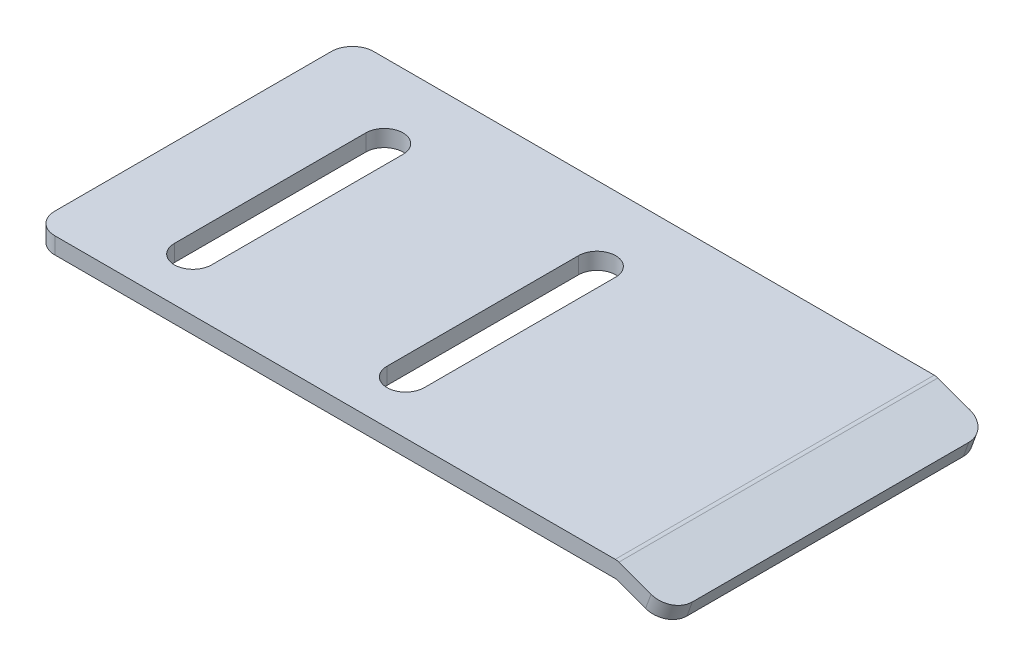
ISO-10303-21;
HEADER;
FILE_DESCRIPTION(('STEP AP214'),'2;1');
FILE_NAME('part.step','',(''),(''),'','','');
FILE_SCHEMA(('AUTOMOTIVE_DESIGN { 1 0 10303 214 1 1 1 1 }'));
ENDSEC;
DATA;
#1=APPLICATION_CONTEXT('core data for automotive mechanical design processes');
#2=APPLICATION_PROTOCOL_DEFINITION('international standard','automotive_design',2000,#1);
#3=PRODUCT_CONTEXT('',#1,'mechanical');
#4=PRODUCT('Part','Part','',(#3));
#5=PRODUCT_RELATED_PRODUCT_CATEGORY('part','',(#4));
#6=PRODUCT_DEFINITION_FORMATION('','',#4);
#7=PRODUCT_DEFINITION_CONTEXT('part definition',#1,'design');
#8=PRODUCT_DEFINITION('design','',#6,#7);
#9=PRODUCT_DEFINITION_SHAPE('','',#8);
#10=(LENGTH_UNIT() NAMED_UNIT(*) SI_UNIT(.MILLI.,.METRE.));
#11=(NAMED_UNIT(*) PLANE_ANGLE_UNIT() SI_UNIT($,.RADIAN.));
#12=(NAMED_UNIT(*) SI_UNIT($,.STERADIAN.) SOLID_ANGLE_UNIT());
#13=UNCERTAINTY_MEASURE_WITH_UNIT(LENGTH_MEASURE(1.E-05),#10,'distance_accuracy_value','');
#14=(GEOMETRIC_REPRESENTATION_CONTEXT(3) GLOBAL_UNCERTAINTY_ASSIGNED_CONTEXT((#13)) GLOBAL_UNIT_ASSIGNED_CONTEXT((#10,
#11,#12)) REPRESENTATION_CONTEXT('',''));
#15=CARTESIAN_POINT('',(0.,0.,0.));
#16=DIRECTION('',(0.,0.,1.));
#17=DIRECTION('',(1.,0.,0.));
#18=AXIS2_PLACEMENT_3D('',#15,#16,#17);
#19=CARTESIAN_POINT('',(-37.5773457805497,7.01414024321962,30.));
#20=DIRECTION('',(1.,0.,0.));
#21=DIRECTION('',(0.,1.,0.));
#22=AXIS2_PLACEMENT_3D('',#19,#20,#21);
#23=PLANE('',#22);
#24=DIRECTION('',(0.,0.,-1.));
#25=VECTOR('',#24,1.);
#26=CARTESIAN_POINT('',(-37.5773457805497,7.01414024321962,30.));
#27=LINE('',#26,#25);
#28=CARTESIAN_POINT('',(-37.5773457805497,7.01414024321962,28.));
#29=VERTEX_POINT('',#28);
#30=CARTESIAN_POINT('',(-37.5773457805497,7.01414024321962,2.));
#31=VERTEX_POINT('',#30);
#32=EDGE_CURVE('E264',#29,#31,#27,.T.);
#33=ORIENTED_EDGE('',*,*,#32,.F.);
#34=DIRECTION('',(0.,-1.,0.));
#35=VECTOR('',#34,1.);
#36=CARTESIAN_POINT('',(-37.5773457805497,7.01414024321962,28.));
#37=LINE('',#36,#35);
#38=CARTESIAN_POINT('',(-37.5773457805497,8.5792292670785,28.));
#39=VERTEX_POINT('',#38);
#40=EDGE_CURVE('E291',#29,#39,#37,.F.);
#41=ORIENTED_EDGE('',*,*,#40,.T.);
#42=DIRECTION('',(0.,0.,-1.));
#43=VECTOR('',#42,1.);
#44=CARTESIAN_POINT('',(-37.5773457805497,8.5792292670785,30.));
#45=LINE('',#44,#43);
#46=CARTESIAN_POINT('',(-37.5773457805497,8.5792292670785,2.));
#47=VERTEX_POINT('',#46);
#48=EDGE_CURVE('E244',#39,#47,#45,.T.);
#49=ORIENTED_EDGE('',*,*,#48,.T.);
#50=DIRECTION('',(0.,-1.,0.));
#51=VECTOR('',#50,1.);
#52=CARTESIAN_POINT('',(-37.5773457805497,7.01414024321962,2.));
#53=LINE('',#52,#51);
#54=EDGE_CURVE('E288',#47,#31,#53,.T.);
#55=ORIENTED_EDGE('',*,*,#54,.T.);
#56=EDGE_LOOP('',(#33,#41,#49,#55));
#57=FACE_BOUND('',#56,.T.);
#58=ADVANCED_FACE('F33',(#57),#23,.F.);
#59=CARTESIAN_POINT('',(17.2226542194503,7.01414024321963,30.));
#60=DIRECTION('',(0.,1.,0.));
#61=DIRECTION('',(-1.,0.,0.));
#62=AXIS2_PLACEMENT_3D('',#59,#60,#61);
#63=PLANE('',#62);
#64=DIRECTION('',(0.,0.,1.));
#65=VECTOR('',#64,1.);
#66=CARTESIAN_POINT('',(-9.32734578054968,7.01414024321962,30.));
#67=LINE('',#66,#65);
#68=CARTESIAN_POINT('',(-9.32734578054968,7.01414024321963,7.));
#69=VERTEX_POINT('',#68);
#70=CARTESIAN_POINT('',(-9.32734578054968,7.01414024321962,25.));
#71=VERTEX_POINT('',#70);
#72=EDGE_CURVE('E194',#69,#71,#67,.T.);
#73=ORIENTED_EDGE('',*,*,#72,.T.);
#74=CARTESIAN_POINT('',(-7.57734578054967,7.01414024321963,25.));
#75=DIRECTION('',(0.,1.,0.));
#76=DIRECTION('',(-1.,0.,0.));
#77=AXIS2_PLACEMENT_3D('',#74,#75,#76);
#78=CIRCLE('',#77,1.75000000000001);
#79=CARTESIAN_POINT('',(-5.82734578054966,7.01414024321963,25.));
#80=VERTEX_POINT('',#79);
#81=EDGE_CURVE('E197',#71,#80,#78,.T.);
#82=ORIENTED_EDGE('',*,*,#81,.T.);
#83=DIRECTION('',(0.,0.,-1.));
#84=VECTOR('',#83,1.);
#85=CARTESIAN_POINT('',(-5.82734578054966,7.01414024321963,30.));
#86=LINE('',#85,#84);
#87=CARTESIAN_POINT('',(-5.82734578054967,7.01414024321963,7.));
#88=VERTEX_POINT('',#87);
#89=EDGE_CURVE('E189',#80,#88,#86,.T.);
#90=ORIENTED_EDGE('',*,*,#89,.T.);
#91=CARTESIAN_POINT('',(-7.57734578054968,7.01414024321963,7.));
#92=DIRECTION('',(0.,1.,0.));
#93=DIRECTION('',(-1.,0.,0.));
#94=AXIS2_PLACEMENT_3D('',#91,#92,#93);
#95=CIRCLE('',#94,1.75);
#96=EDGE_CURVE('E169',#88,#69,#95,.T.);
#97=ORIENTED_EDGE('',*,*,#96,.T.);
#98=EDGE_LOOP('',(#73,#82,#90,#97));
#99=FACE_BOUND('',#98,.T.);
#100=DIRECTION('',(0.,0.,1.));
#101=VECTOR('',#100,1.);
#102=CARTESIAN_POINT('',(-29.3273457805497,7.01414024321962,30.));
#103=LINE('',#102,#101);
#104=CARTESIAN_POINT('',(-29.3273457805497,7.01414024321962,7.));
#105=VERTEX_POINT('',#104);
#106=CARTESIAN_POINT('',(-29.3273457805497,7.01414024321962,25.));
#107=VERTEX_POINT('',#106);
#108=EDGE_CURVE('E226',#105,#107,#103,.T.);
#109=ORIENTED_EDGE('',*,*,#108,.T.);
#110=CARTESIAN_POINT('',(-27.5773457805497,7.01414024321962,25.));
#111=DIRECTION('',(0.,1.,0.));
#112=DIRECTION('',(-1.,0.,0.));
#113=AXIS2_PLACEMENT_3D('',#110,#111,#112);
#114=CIRCLE('',#113,1.75000000000001);
#115=CARTESIAN_POINT('',(-25.8273457805497,7.01414024321962,25.));
#116=VERTEX_POINT('',#115);
#117=EDGE_CURVE('E229',#107,#116,#114,.T.);
#118=ORIENTED_EDGE('',*,*,#117,.T.);
#119=DIRECTION('',(0.,0.,-1.));
#120=VECTOR('',#119,1.);
#121=CARTESIAN_POINT('',(-25.8273457805496,7.01414024321962,30.));
#122=LINE('',#121,#120);
#123=CARTESIAN_POINT('',(-25.8273457805497,7.01414024321962,7.));
#124=VERTEX_POINT('',#123);
#125=EDGE_CURVE('E214',#116,#124,#122,.T.);
#126=ORIENTED_EDGE('',*,*,#125,.T.);
#127=CARTESIAN_POINT('',(-27.5773457805497,7.01414024321962,7.));
#128=DIRECTION('',(0.,1.,0.));
#129=DIRECTION('',(-1.,0.,0.));
#130=AXIS2_PLACEMENT_3D('',#127,#128,#129);
#131=CIRCLE('',#130,1.75);
#132=EDGE_CURVE('E223',#124,#105,#131,.T.);
#133=ORIENTED_EDGE('',*,*,#132,.T.);
#134=EDGE_LOOP('',(#109,#118,#126,#133));
#135=FACE_BOUND('',#134,.T.);
#136=DIRECTION('',(1.,0.,0.));
#137=VECTOR('',#136,1.);
#138=CARTESIAN_POINT('',(17.2226542194503,7.01414024321963,30.));
#139=LINE('',#138,#137);
#140=CARTESIAN_POINT('',(-35.5773457805496,7.01414024321962,30.));
#141=VERTEX_POINT('',#140);
#142=CARTESIAN_POINT('',(17.2226542194503,7.01414024321963,30.));
#143=VERTEX_POINT('',#142);
#144=EDGE_CURVE('E233',#141,#143,#139,.T.);
#145=ORIENTED_EDGE('',*,*,#144,.F.);
#146=CARTESIAN_POINT('',(-35.5773457805497,7.01414024321962,28.));
#147=DIRECTION('',(0.,1.,0.));
#148=DIRECTION('',(-1.,0.,0.));
#149=AXIS2_PLACEMENT_3D('',#146,#147,#148);
#150=CIRCLE('',#149,2.);
#151=EDGE_CURVE('E286',#141,#29,#150,.F.);
#152=ORIENTED_EDGE('',*,*,#151,.T.);
#153=ORIENTED_EDGE('',*,*,#32,.T.);
#154=CARTESIAN_POINT('',(-35.5773457805497,7.01414024321962,2.));
#155=DIRECTION('',(0.,1.,0.));
#156=DIRECTION('',(-1.,0.,0.));
#157=AXIS2_PLACEMENT_3D('',#154,#155,#156);
#158=CIRCLE('',#157,2.);
#159=CARTESIAN_POINT('',(-35.5773457805496,7.01414024321962,0.));
#160=VERTEX_POINT('',#159);
#161=EDGE_CURVE('E284',#31,#160,#158,.F.);
#162=ORIENTED_EDGE('',*,*,#161,.T.);
#163=DIRECTION('',(1.,0.,0.));
#164=VECTOR('',#163,1.);
#165=CARTESIAN_POINT('',(17.2226542194503,7.01414024321963,0.));
#166=LINE('',#165,#164);
#167=CARTESIAN_POINT('',(17.2226542194503,7.01414024321963,0.));
#168=VERTEX_POINT('',#167);
#169=EDGE_CURVE('E232',#160,#168,#166,.T.);
#170=ORIENTED_EDGE('',*,*,#169,.T.);
#171=DIRECTION('',(0.,0.,-1.));
#172=VECTOR('',#171,1.);
#173=CARTESIAN_POINT('',(17.2226542194503,7.01414024321963,30.));
#174=LINE('',#173,#172);
#175=EDGE_CURVE('E261',#143,#168,#174,.T.);
#176=ORIENTED_EDGE('',*,*,#175,.F.);
#177=EDGE_LOOP('',(#145,#152,#153,#162,#170,#176));
#178=FACE_BOUND('',#177,.T.);
#179=ADVANCED_FACE('F359',(#99,#135,#178),#63,.F.);
#180=CARTESIAN_POINT('',(21.8696240044618,5.32278156194103,30.));
#181=DIRECTION('',(0.342020143325669,0.939692620785908,0.));
#182=DIRECTION('',(-0.939692620785908,0.342020143325669,0.));
#183=AXIS2_PLACEMENT_3D('',#180,#181,#182);
#184=PLANE('',#183);
#185=DIRECTION('',(0.,0.,-1.));
#186=VECTOR('',#185,1.);
#187=CARTESIAN_POINT('',(21.8696240044618,5.32278156194103,30.));
#188=LINE('',#187,#186);
#189=CARTESIAN_POINT('',(21.8696240044618,5.32278156194103,28.));
#190=VERTEX_POINT('',#189);
#191=CARTESIAN_POINT('',(21.8696240044618,5.32278156194103,2.));
#192=VERTEX_POINT('',#191);
#193=EDGE_CURVE('E258',#190,#192,#188,.T.);
#194=ORIENTED_EDGE('',*,*,#193,.F.);
#195=CARTESIAN_POINT('',(19.99023876289,6.00682184859236,28.));
#196=DIRECTION('',(0.342020143325669,0.939692620785908,0.));
#197=DIRECTION('',(-0.939692620785908,0.342020143325669,0.));
#198=AXIS2_PLACEMENT_3D('',#195,#196,#197);
#199=CIRCLE('',#198,2.);
#200=CARTESIAN_POINT('',(19.99023876289,6.00682184859237,30.));
#201=VERTEX_POINT('',#200);
#202=EDGE_CURVE('E11',#190,#201,#199,.F.);
#203=ORIENTED_EDGE('',*,*,#202,.T.);
#204=DIRECTION('',(0.939692620785908,-0.342020143325669,0.));
#205=VECTOR('',#204,1.);
#206=CARTESIAN_POINT('',(21.8696240044618,5.32278156194103,30.));
#207=LINE('',#206,#205);
#208=EDGE_CURVE('E235',#143,#201,#207,.T.);
#209=ORIENTED_EDGE('',*,*,#208,.F.);
#210=ORIENTED_EDGE('',*,*,#175,.T.);
#211=DIRECTION('',(0.939692620785908,-0.342020143325669,0.));
#212=VECTOR('',#211,1.);
#213=CARTESIAN_POINT('',(21.8696240044618,5.32278156194103,0.));
#214=LINE('',#213,#212);
#215=CARTESIAN_POINT('',(19.99023876289,6.00682184859236,0.));
#216=VERTEX_POINT('',#215);
#217=EDGE_CURVE('E246',#168,#216,#214,.T.);
#218=ORIENTED_EDGE('',*,*,#217,.T.);
#219=CARTESIAN_POINT('',(19.99023876289,6.00682184859237,2.));
#220=DIRECTION('',(0.342020143325669,0.939692620785908,0.));
#221=DIRECTION('',(-0.939692620785908,0.342020143325669,0.));
#222=AXIS2_PLACEMENT_3D('',#219,#220,#221);
#223=CIRCLE('',#222,2.);
#224=EDGE_CURVE('E41',#216,#192,#223,.F.);
#225=ORIENTED_EDGE('',*,*,#224,.T.);
#226=EDGE_LOOP('',(#194,#203,#209,#210,#218,#225));
#227=FACE_BOUND('',#226,.T.);
#228=ADVANCED_FACE('F312',(#227),#184,.F.);
#229=CARTESIAN_POINT('',(22.3826542194503,6.73232049311989,30.));
#230=DIRECTION('',(-0.939692620785908,0.342020143325669,0.));
#231=DIRECTION('',(-0.342020143325669,-0.939692620785908,0.));
#232=AXIS2_PLACEMENT_3D('',#229,#230,#231);
#233=PLANE('',#232);
#234=DIRECTION('',(0.,0.,-1.));
#235=VECTOR('',#234,1.);
#236=CARTESIAN_POINT('',(22.3826542194503,6.73232049311989,30.));
#237=LINE('',#236,#235);
#238=CARTESIAN_POINT('',(22.3826542194503,6.73232049311989,28.));
#239=VERTEX_POINT('',#238);
#240=CARTESIAN_POINT('',(22.3826542194503,6.73232049311989,2.));
#241=VERTEX_POINT('',#240);
#242=EDGE_CURVE('E255',#239,#241,#237,.T.);
#243=ORIENTED_EDGE('',*,*,#242,.F.);
#244=DIRECTION('',(0.342020143325669,0.939692620785908,0.));
#245=VECTOR('',#244,1.);
#246=CARTESIAN_POINT('',(22.3826542194503,6.73232049311989,28.));
#247=LINE('',#246,#245);
#248=EDGE_CURVE('E308',#239,#190,#247,.F.);
#249=ORIENTED_EDGE('',*,*,#248,.T.);
#250=ORIENTED_EDGE('',*,*,#193,.T.);
#251=DIRECTION('',(0.342020143325669,0.939692620785908,0.));
#252=VECTOR('',#251,1.);
#253=CARTESIAN_POINT('',(22.3826542194503,6.73232049311989,2.));
#254=LINE('',#253,#252);
#255=EDGE_CURVE('E305',#192,#241,#254,.T.);
#256=ORIENTED_EDGE('',*,*,#255,.T.);
#257=EDGE_LOOP('',(#243,#249,#250,#256));
#258=FACE_BOUND('',#257,.T.);
#259=ADVANCED_FACE('F320',(#258),#233,.F.);
#260=CARTESIAN_POINT('',(17.3083140672064,8.5792292670785,30.));
#261=DIRECTION('',(-0.342020143325669,-0.939692620785908,0.));
#262=DIRECTION('',(0.939692620785908,-0.342020143325669,0.));
#263=AXIS2_PLACEMENT_3D('',#260,#261,#262);
#264=PLANE('',#263);
#265=DIRECTION('',(-0.939692620785908,0.342020143325669,0.));
#266=VECTOR('',#265,1.);
#267=CARTESIAN_POINT('',(17.3083140672064,8.5792292670785,30.));
#268=LINE('',#267,#266);
#269=CARTESIAN_POINT('',(20.5032689778785,7.41636077977123,30.));
#270=VERTEX_POINT('',#269);
#271=CARTESIAN_POINT('',(17.4740072298236,8.51892188786441,30.));
#272=VERTEX_POINT('',#271);
#273=EDGE_CURVE('E239',#270,#272,#268,.T.);
#274=ORIENTED_EDGE('',*,*,#273,.F.);
#275=CARTESIAN_POINT('',(20.5032689778785,7.41636077977123,28.));
#276=DIRECTION('',(-0.342020143325669,-0.939692620785908,0.));
#277=DIRECTION('',(0.939692620785908,-0.342020143325669,0.));
#278=AXIS2_PLACEMENT_3D('',#275,#276,#277);
#279=CIRCLE('',#278,2.);
#280=EDGE_CURVE('E303',#270,#239,#279,.F.);
#281=ORIENTED_EDGE('',*,*,#280,.T.);
#282=ORIENTED_EDGE('',*,*,#242,.T.);
#283=CARTESIAN_POINT('',(20.5032689778785,7.41636077977123,2.));
#284=DIRECTION('',(-0.342020143325669,-0.939692620785908,0.));
#285=DIRECTION('',(0.939692620785908,-0.342020143325669,0.));
#286=AXIS2_PLACEMENT_3D('',#283,#284,#285);
#287=CIRCLE('',#286,2.);
#288=CARTESIAN_POINT('',(20.5032689778785,7.41636077977123,0.));
#289=VERTEX_POINT('',#288);
#290=EDGE_CURVE('E301',#241,#289,#287,.F.);
#291=ORIENTED_EDGE('',*,*,#290,.T.);
#292=DIRECTION('',(-0.939692620785908,0.342020143325669,0.));
#293=VECTOR('',#292,1.);
#294=CARTESIAN_POINT('',(17.3083140672064,8.5792292670785,0.));
#295=LINE('',#294,#293);
#296=CARTESIAN_POINT('',(17.4740072298236,8.51892188786441,0.));
#297=VERTEX_POINT('',#296);
#298=EDGE_CURVE('E249',#289,#297,#295,.T.);
#299=ORIENTED_EDGE('',*,*,#298,.T.);
#300=DIRECTION('',(0.,0.,-1.));
#301=VECTOR('',#300,1.);
#302=CARTESIAN_POINT('',(17.4740072298236,8.51892188786441,30.));
#303=LINE('',#302,#301);
#304=EDGE_CURVE('E273',#297,#272,#303,.F.);
#305=ORIENTED_EDGE('',*,*,#304,.T.);
#306=EDGE_LOOP('',(#274,#281,#282,#291,#299,#305));
#307=FACE_BOUND('',#306,.T.);
#308=ADVANCED_FACE('F325',(#307),#264,.F.);
#309=CARTESIAN_POINT('',(-37.5773457805497,8.5792292670785,30.));
#310=DIRECTION('',(0.,-1.,0.));
#311=DIRECTION('',(0.,0.,-1.));
#312=AXIS2_PLACEMENT_3D('',#309,#310,#311);
#313=PLANE('',#312);
#314=DIRECTION('',(0.,0.,-1.));
#315=VECTOR('',#314,1.);
#316=CARTESIAN_POINT('',(-5.82734578054966,8.5792292670785,25.));
#317=LINE('',#316,#315);
#318=CARTESIAN_POINT('',(-5.82734578054967,8.5792292670785,25.));
#319=VERTEX_POINT('',#318);
#320=CARTESIAN_POINT('',(-5.82734578054968,8.5792292670785,7.));
#321=VERTEX_POINT('',#320);
#322=EDGE_CURVE('E175',#319,#321,#317,.T.);
#323=ORIENTED_EDGE('',*,*,#322,.F.);
#324=CARTESIAN_POINT('',(-7.57734578054967,8.5792292670785,25.));
#325=DIRECTION('',(0.,1.,0.));
#326=DIRECTION('',(0.,0.,1.));
#327=AXIS2_PLACEMENT_3D('',#324,#325,#326);
#328=CIRCLE('',#327,1.75000000000001);
#329=CARTESIAN_POINT('',(-9.32734578054968,8.5792292670785,25.));
#330=VERTEX_POINT('',#329);
#331=EDGE_CURVE('E56',#330,#319,#328,.T.);
#332=ORIENTED_EDGE('',*,*,#331,.F.);
#333=DIRECTION('',(0.,0.,1.));
#334=VECTOR('',#333,1.);
#335=CARTESIAN_POINT('',(-9.32734578054968,8.5792292670785,25.));
#336=LINE('',#335,#334);
#337=CARTESIAN_POINT('',(-9.32734578054968,8.5792292670785,7.));
#338=VERTEX_POINT('',#337);
#339=EDGE_CURVE('E182',#338,#330,#336,.T.);
#340=ORIENTED_EDGE('',*,*,#339,.F.);
#341=CARTESIAN_POINT('',(-7.57734578054968,8.5792292670785,7.));
#342=DIRECTION('',(0.,1.,0.));
#343=DIRECTION('',(0.,0.,1.));
#344=AXIS2_PLACEMENT_3D('',#341,#342,#343);
#345=CIRCLE('',#344,1.75);
#346=EDGE_CURVE('E166',#321,#338,#345,.T.);
#347=ORIENTED_EDGE('',*,*,#346,.F.);
#348=EDGE_LOOP('',(#323,#332,#340,#347));
#349=FACE_BOUND('',#348,.T.);
#350=DIRECTION('',(0.,0.,-1.));
#351=VECTOR('',#350,1.);
#352=CARTESIAN_POINT('',(-25.8273457805497,8.5792292670785,25.));
#353=LINE('',#352,#351);
#354=CARTESIAN_POINT('',(-25.8273457805497,8.5792292670785,25.));
#355=VERTEX_POINT('',#354);
#356=CARTESIAN_POINT('',(-25.8273457805497,8.5792292670785,7.));
#357=VERTEX_POINT('',#356);
#358=EDGE_CURVE('E202',#355,#357,#353,.T.);
#359=ORIENTED_EDGE('',*,*,#358,.F.);
#360=CARTESIAN_POINT('',(-27.5773457805497,8.5792292670785,25.));
#361=DIRECTION('',(0.,1.,0.));
#362=DIRECTION('',(0.,0.,1.));
#363=AXIS2_PLACEMENT_3D('',#360,#361,#362);
#364=CIRCLE('',#363,1.75000000000001);
#365=CARTESIAN_POINT('',(-29.3273457805497,8.5792292670785,25.));
#366=VERTEX_POINT('',#365);
#367=EDGE_CURVE('E200',#366,#355,#364,.T.);
#368=ORIENTED_EDGE('',*,*,#367,.F.);
#369=DIRECTION('',(0.,0.,1.));
#370=VECTOR('',#369,1.);
#371=CARTESIAN_POINT('',(-29.3273457805497,8.5792292670785,25.));
#372=LINE('',#371,#370);
#373=CARTESIAN_POINT('',(-29.3273457805497,8.5792292670785,7.));
#374=VERTEX_POINT('',#373);
#375=EDGE_CURVE('E208',#374,#366,#372,.T.);
#376=ORIENTED_EDGE('',*,*,#375,.F.);
#377=CARTESIAN_POINT('',(-27.5773457805497,8.5792292670785,7.));
#378=DIRECTION('',(0.,1.,0.));
#379=DIRECTION('',(0.,0.,1.));
#380=AXIS2_PLACEMENT_3D('',#377,#378,#379);
#381=CIRCLE('',#380,1.75);
#382=EDGE_CURVE('E205',#357,#374,#381,.T.);
#383=ORIENTED_EDGE('',*,*,#382,.F.);
#384=EDGE_LOOP('',(#359,#368,#376,#383));
#385=FACE_BOUND('',#384,.T.);
#386=ORIENTED_EDGE('',*,*,#48,.F.);
#387=CARTESIAN_POINT('',(-35.5773457805497,8.5792292670785,28.));
#388=DIRECTION('',(0.,-1.,0.));
#389=DIRECTION('',(0.,0.,-1.));
#390=AXIS2_PLACEMENT_3D('',#387,#388,#389);
#391=CIRCLE('',#390,2.);
#392=CARTESIAN_POINT('',(-35.5773457805497,8.5792292670785,30.));
#393=VERTEX_POINT('',#392);
#394=EDGE_CURVE('E295',#39,#393,#391,.F.);
#395=ORIENTED_EDGE('',*,*,#394,.T.);
#396=DIRECTION('',(-1.,0.,0.));
#397=VECTOR('',#396,1.);
#398=CARTESIAN_POINT('',(-37.5773457805497,8.5792292670785,30.));
#399=LINE('',#398,#397);
#400=CARTESIAN_POINT('',(17.131987086498,8.5792292670785,30.));
#401=VERTEX_POINT('',#400);
#402=EDGE_CURVE('E241',#401,#393,#399,.T.);
#403=ORIENTED_EDGE('',*,*,#402,.F.);
#404=DIRECTION('',(0.,0.,-1.));
#405=VECTOR('',#404,1.);
#406=CARTESIAN_POINT('',(17.131987086498,8.5792292670785,30.));
#407=LINE('',#406,#405);
#408=CARTESIAN_POINT('',(17.131987086498,8.5792292670785,0.));
#409=VERTEX_POINT('',#408);
#410=EDGE_CURVE('E267',#401,#409,#407,.T.);
#411=ORIENTED_EDGE('',*,*,#410,.T.);
#412=DIRECTION('',(-1.,0.,0.));
#413=VECTOR('',#412,1.);
#414=CARTESIAN_POINT('',(-37.5773457805497,8.5792292670785,0.));
#415=LINE('',#414,#413);
#416=CARTESIAN_POINT('',(-35.5773457805497,8.5792292670785,0.));
#417=VERTEX_POINT('',#416);
#418=EDGE_CURVE('E236',#409,#417,#415,.T.);
#419=ORIENTED_EDGE('',*,*,#418,.T.);
#420=CARTESIAN_POINT('',(-35.5773457805497,8.5792292670785,2.));
#421=DIRECTION('',(0.,-1.,0.));
#422=DIRECTION('',(0.,0.,-1.));
#423=AXIS2_PLACEMENT_3D('',#420,#421,#422);
#424=CIRCLE('',#423,2.);
#425=EDGE_CURVE('E293',#417,#47,#424,.F.);
#426=ORIENTED_EDGE('',*,*,#425,.T.);
#427=EDGE_LOOP('',(#386,#395,#403,#411,#419,#426));
#428=FACE_BOUND('',#427,.T.);
#429=ADVANCED_FACE('F179',(#349,#385,#428),#313,.F.);
#430=CARTESIAN_POINT('',(0.,0.,30.));
#431=DIRECTION('',(0.,0.,-1.));
#432=DIRECTION('',(-1.,0.,0.));
#433=AXIS2_PLACEMENT_3D('',#430,#431,#432);
#434=PLANE('',#433);
#435=ORIENTED_EDGE('',*,*,#402,.T.);
#436=DIRECTION('',(0.,-1.,0.));
#437=VECTOR('',#436,1.);
#438=CARTESIAN_POINT('',(-35.5773457805496,-1.57733792768656E-13,30.));
#439=LINE('',#438,#437);
#440=EDGE_CURVE('E281',#393,#141,#439,.T.);
#441=ORIENTED_EDGE('',*,*,#440,.T.);
#442=ORIENTED_EDGE('',*,*,#144,.T.);
#443=ORIENTED_EDGE('',*,*,#208,.T.);
#444=DIRECTION('',(0.342020143325669,0.939692620785908,0.));
#445=VECTOR('',#444,1.);
#446=CARTESIAN_POINT('',(15.721269712977,-5.72207422039438,30.));
#447=LINE('',#446,#445);
#448=EDGE_CURVE('E278',#201,#270,#447,.T.);
#449=ORIENTED_EDGE('',*,*,#448,.T.);
#450=ORIENTED_EDGE('',*,*,#273,.T.);
#451=CARTESIAN_POINT('',(17.131987086498,7.5792292670785,30.));
#452=DIRECTION('',(0.,0.,-1.));
#453=DIRECTION('',(-1.,0.,0.));
#454=AXIS2_PLACEMENT_3D('',#451,#452,#453);
#455=CIRCLE('',#454,1.);
#456=EDGE_CURVE('E276',#272,#401,#455,.F.);
#457=ORIENTED_EDGE('',*,*,#456,.T.);
#458=EDGE_LOOP('',(#435,#441,#442,#443,#449,#450,#457));
#459=FACE_BOUND('',#458,.T.);
#460=ADVANCED_FACE('F336',(#459),#434,.F.);
#461=CARTESIAN_POINT('',(0.,0.,0.));
#462=DIRECTION('',(0.,0.,-1.));
#463=DIRECTION('',(-1.,0.,0.));
#464=AXIS2_PLACEMENT_3D('',#461,#462,#463);
#465=PLANE('',#464);
#466=ORIENTED_EDGE('',*,*,#169,.F.);
#467=DIRECTION('',(0.,-1.,0.));
#468=VECTOR('',#467,1.);
#469=CARTESIAN_POINT('',(-35.5773457805497,8.57922926707851,0.));
#470=LINE('',#469,#468);
#471=EDGE_CURVE('E299',#160,#417,#470,.F.);
#472=ORIENTED_EDGE('',*,*,#471,.T.);
#473=ORIENTED_EDGE('',*,*,#418,.F.);
#474=CARTESIAN_POINT('',(17.131987086498,7.5792292670785,0.));
#475=DIRECTION('',(0.,0.,-1.));
#476=DIRECTION('',(-1.,0.,0.));
#477=AXIS2_PLACEMENT_3D('',#474,#475,#476);
#478=CIRCLE('',#477,1.);
#479=EDGE_CURVE('E270',#409,#297,#478,.T.);
#480=ORIENTED_EDGE('',*,*,#479,.T.);
#481=ORIENTED_EDGE('',*,*,#298,.F.);
#482=DIRECTION('',(0.342020143325669,0.939692620785908,0.));
#483=VECTOR('',#482,1.);
#484=CARTESIAN_POINT('',(19.99023876289,6.00682184859236,0.));
#485=LINE('',#484,#483);
#486=EDGE_CURVE('E297',#289,#216,#485,.F.);
#487=ORIENTED_EDGE('',*,*,#486,.T.);
#488=ORIENTED_EDGE('',*,*,#217,.F.);
#489=EDGE_LOOP('',(#466,#472,#473,#480,#481,#487,#488));
#490=FACE_BOUND('',#489,.T.);
#491=ADVANCED_FACE('F328',(#490),#465,.T.);
#492=CARTESIAN_POINT('',(17.131987086498,7.5792292670785,30.));
#493=DIRECTION('',(0.,0.,-1.));
#494=DIRECTION('',(-1.,0.,0.));
#495=AXIS2_PLACEMENT_3D('',#492,#493,#494);
#496=CYLINDRICAL_SURFACE('',#495,1.);
#497=ORIENTED_EDGE('',*,*,#456,.F.);
#498=ORIENTED_EDGE('',*,*,#304,.F.);
#499=ORIENTED_EDGE('',*,*,#479,.F.);
#500=ORIENTED_EDGE('',*,*,#410,.F.);
#501=EDGE_LOOP('',(#497,#498,#499,#500));
#502=FACE_BOUND('',#501,.T.);
#503=ADVANCED_FACE('F334',(#502),#496,.T.);
#504=CARTESIAN_POINT('',(-35.5773457805496,-1.57733792768656E-13,28.));
#505=DIRECTION('',(0.,-1.,0.));
#506=DIRECTION('',(1.,0.,0.));
#507=AXIS2_PLACEMENT_3D('',#504,#505,#506);
#508=CYLINDRICAL_SURFACE('',#507,2.);
#509=ORIENTED_EDGE('',*,*,#394,.F.);
#510=ORIENTED_EDGE('',*,*,#40,.F.);
#511=ORIENTED_EDGE('',*,*,#151,.F.);
#512=ORIENTED_EDGE('',*,*,#440,.F.);
#513=EDGE_LOOP('',(#509,#510,#511,#512));
#514=FACE_BOUND('',#513,.T.);
#515=ADVANCED_FACE('F357',(#514),#508,.T.);
#516=CARTESIAN_POINT('',(-35.5773457805497,7.01414024321963,2.));
#517=DIRECTION('',(0.,1.,0.));
#518=DIRECTION('',(-1.,0.,0.));
#519=AXIS2_PLACEMENT_3D('',#516,#517,#518);
#520=CYLINDRICAL_SURFACE('',#519,2.);
#521=ORIENTED_EDGE('',*,*,#425,.F.);
#522=ORIENTED_EDGE('',*,*,#471,.F.);
#523=ORIENTED_EDGE('',*,*,#161,.F.);
#524=ORIENTED_EDGE('',*,*,#54,.F.);
#525=EDGE_LOOP('',(#521,#522,#523,#524));
#526=FACE_BOUND('',#525,.T.);
#527=ADVANCED_FACE('F348',(#526),#520,.T.);
#528=CARTESIAN_POINT('',(15.721269712977,-5.72207422039438,28.));
#529=DIRECTION('',(0.342020143325669,0.939692620785908,0.));
#530=DIRECTION('',(-0.939692620785908,0.342020143325669,0.));
#531=AXIS2_PLACEMENT_3D('',#528,#529,#530);
#532=CYLINDRICAL_SURFACE('',#531,2.);
#533=ORIENTED_EDGE('',*,*,#202,.F.);
#534=ORIENTED_EDGE('',*,*,#248,.F.);
#535=ORIENTED_EDGE('',*,*,#280,.F.);
#536=ORIENTED_EDGE('',*,*,#448,.F.);
#537=EDGE_LOOP('',(#533,#534,#535,#536));
#538=FACE_BOUND('',#537,.T.);
#539=ADVANCED_FACE('F341',(#538),#532,.T.);
#540=CARTESIAN_POINT('',(20.5032689778785,7.41636077977123,2.));
#541=DIRECTION('',(-0.342020143325669,-0.939692620785908,0.));
#542=DIRECTION('',(0.939692620785908,-0.342020143325669,0.));
#543=AXIS2_PLACEMENT_3D('',#540,#541,#542);
#544=CYLINDRICAL_SURFACE('',#543,2.);
#545=ORIENTED_EDGE('',*,*,#224,.F.);
#546=ORIENTED_EDGE('',*,*,#486,.F.);
#547=ORIENTED_EDGE('',*,*,#290,.F.);
#548=ORIENTED_EDGE('',*,*,#255,.F.);
#549=EDGE_LOOP('',(#545,#546,#547,#548));
#550=FACE_BOUND('',#549,.T.);
#551=ADVANCED_FACE('F35',(#550),#544,.T.);
#552=CARTESIAN_POINT('',(-27.5773457805497,5.32278156194102,25.));
#553=DIRECTION('',(0.,1.,0.));
#554=DIRECTION('',(0.,0.,1.));
#555=AXIS2_PLACEMENT_3D('',#552,#553,#554);
#556=CYLINDRICAL_SURFACE('',#555,1.75000000000001);
#557=DIRECTION('',(0.,1.,0.));
#558=VECTOR('',#557,1.);
#559=CARTESIAN_POINT('',(-29.3273457805497,5.32278156194102,25.));
#560=LINE('',#559,#558);
#561=EDGE_CURVE('E212',#107,#366,#560,.T.);
#562=ORIENTED_EDGE('',*,*,#561,.T.);
#563=ORIENTED_EDGE('',*,*,#367,.T.);
#564=DIRECTION('',(0.,1.,0.));
#565=VECTOR('',#564,1.);
#566=CARTESIAN_POINT('',(-25.8273457805497,5.32278156194102,25.));
#567=LINE('',#566,#565);
#568=EDGE_CURVE('E211',#116,#355,#567,.T.);
#569=ORIENTED_EDGE('',*,*,#568,.F.);
#570=ORIENTED_EDGE('',*,*,#117,.F.);
#571=EDGE_LOOP('',(#562,#563,#569,#570));
#572=FACE_BOUND('',#571,.T.);
#573=ADVANCED_FACE('F381',(#572),#556,.F.);
#574=CARTESIAN_POINT('',(-29.3273457805497,5.32278156194102,25.));
#575=DIRECTION('',(-1.,0.,0.));
#576=DIRECTION('',(0.,0.,1.));
#577=AXIS2_PLACEMENT_3D('',#574,#575,#576);
#578=PLANE('',#577);
#579=DIRECTION('',(0.,1.,0.));
#580=VECTOR('',#579,1.);
#581=CARTESIAN_POINT('',(-29.3273457805497,5.32278156194102,7.));
#582=LINE('',#581,#580);
#583=EDGE_CURVE('E215',#105,#374,#582,.T.);
#584=ORIENTED_EDGE('',*,*,#583,.T.);
#585=ORIENTED_EDGE('',*,*,#375,.T.);
#586=ORIENTED_EDGE('',*,*,#561,.F.);
#587=ORIENTED_EDGE('',*,*,#108,.F.);
#588=EDGE_LOOP('',(#584,#585,#586,#587));
#589=FACE_BOUND('',#588,.T.);
#590=ADVANCED_FACE('F385',(#589),#578,.F.);
#591=CARTESIAN_POINT('',(-27.5773457805497,5.32278156194102,7.));
#592=DIRECTION('',(0.,1.,0.));
#593=DIRECTION('',(0.,0.,1.));
#594=AXIS2_PLACEMENT_3D('',#591,#592,#593);
#595=CYLINDRICAL_SURFACE('',#594,1.75);
#596=DIRECTION('',(0.,1.,0.));
#597=VECTOR('',#596,1.);
#598=CARTESIAN_POINT('',(-25.8273457805497,5.32278156194102,7.));
#599=LINE('',#598,#597);
#600=EDGE_CURVE('E217',#124,#357,#599,.T.);
#601=ORIENTED_EDGE('',*,*,#600,.T.);
#602=ORIENTED_EDGE('',*,*,#382,.T.);
#603=ORIENTED_EDGE('',*,*,#583,.F.);
#604=ORIENTED_EDGE('',*,*,#132,.F.);
#605=EDGE_LOOP('',(#601,#602,#603,#604));
#606=FACE_BOUND('',#605,.T.);
#607=ADVANCED_FACE('F391',(#606),#595,.F.);
#608=CARTESIAN_POINT('',(-25.8273457805497,5.32278156194102,25.));
#609=DIRECTION('',(1.,0.,0.));
#610=DIRECTION('',(0.,0.,-1.));
#611=AXIS2_PLACEMENT_3D('',#608,#609,#610);
#612=PLANE('',#611);
#613=ORIENTED_EDGE('',*,*,#568,.T.);
#614=ORIENTED_EDGE('',*,*,#358,.T.);
#615=ORIENTED_EDGE('',*,*,#600,.F.);
#616=ORIENTED_EDGE('',*,*,#125,.F.);
#617=EDGE_LOOP('',(#613,#614,#615,#616));
#618=FACE_BOUND('',#617,.T.);
#619=ADVANCED_FACE('F396',(#618),#612,.F.);
#620=CARTESIAN_POINT('',(-7.57734578054967,5.32278156194102,25.));
#621=DIRECTION('',(0.,1.,0.));
#622=DIRECTION('',(0.,0.,1.));
#623=AXIS2_PLACEMENT_3D('',#620,#621,#622);
#624=CYLINDRICAL_SURFACE('',#623,1.75000000000001);
#625=DIRECTION('',(0.,1.,0.));
#626=VECTOR('',#625,1.);
#627=CARTESIAN_POINT('',(-9.32734578054968,5.32278156194102,25.));
#628=LINE('',#627,#626);
#629=EDGE_CURVE('E187',#71,#330,#628,.T.);
#630=ORIENTED_EDGE('',*,*,#629,.T.);
#631=ORIENTED_EDGE('',*,*,#331,.T.);
#632=DIRECTION('',(0.,1.,0.));
#633=VECTOR('',#632,1.);
#634=CARTESIAN_POINT('',(-5.82734578054966,5.32278156194102,25.));
#635=LINE('',#634,#633);
#636=EDGE_CURVE('E172',#80,#319,#635,.T.);
#637=ORIENTED_EDGE('',*,*,#636,.F.);
#638=ORIENTED_EDGE('',*,*,#81,.F.);
#639=EDGE_LOOP('',(#630,#631,#637,#638));
#640=FACE_BOUND('',#639,.T.);
#641=ADVANCED_FACE('F500',(#640),#624,.F.);
#642=CARTESIAN_POINT('',(-9.32734578054968,5.32278156194102,25.));
#643=DIRECTION('',(-1.,0.,0.));
#644=DIRECTION('',(0.,0.,1.));
#645=AXIS2_PLACEMENT_3D('',#642,#643,#644);
#646=PLANE('',#645);
#647=DIRECTION('',(0.,1.,0.));
#648=VECTOR('',#647,1.);
#649=CARTESIAN_POINT('',(-9.32734578054968,5.32278156194102,7.));
#650=LINE('',#649,#648);
#651=EDGE_CURVE('E171',#69,#338,#650,.T.);
#652=ORIENTED_EDGE('',*,*,#651,.T.);
#653=ORIENTED_EDGE('',*,*,#339,.T.);
#654=ORIENTED_EDGE('',*,*,#629,.F.);
#655=ORIENTED_EDGE('',*,*,#72,.F.);
#656=EDGE_LOOP('',(#652,#653,#654,#655));
#657=FACE_BOUND('',#656,.T.);
#658=ADVANCED_FACE('F508',(#657),#646,.F.);
#659=CARTESIAN_POINT('',(-7.57734578054968,5.32278156194102,7.));
#660=DIRECTION('',(0.,1.,0.));
#661=DIRECTION('',(0.,0.,1.));
#662=AXIS2_PLACEMENT_3D('',#659,#660,#661);
#663=CYLINDRICAL_SURFACE('',#662,1.75);
#664=DIRECTION('',(0.,1.,0.));
#665=VECTOR('',#664,1.);
#666=CARTESIAN_POINT('',(-5.82734578054968,5.32278156194102,7.));
#667=LINE('',#666,#665);
#668=EDGE_CURVE('E48',#88,#321,#667,.T.);
#669=ORIENTED_EDGE('',*,*,#668,.T.);
#670=ORIENTED_EDGE('',*,*,#346,.T.);
#671=ORIENTED_EDGE('',*,*,#651,.F.);
#672=ORIENTED_EDGE('',*,*,#96,.F.);
#673=EDGE_LOOP('',(#669,#670,#671,#672));
#674=FACE_BOUND('',#673,.T.);
#675=ADVANCED_FACE('F163',(#674),#663,.F.);
#676=CARTESIAN_POINT('',(-5.82734578054966,5.32278156194102,25.));
#677=DIRECTION('',(1.,0.,0.));
#678=DIRECTION('',(0.,0.,-1.));
#679=AXIS2_PLACEMENT_3D('',#676,#677,#678);
#680=PLANE('',#679);
#681=ORIENTED_EDGE('',*,*,#636,.T.);
#682=ORIENTED_EDGE('',*,*,#322,.T.);
#683=ORIENTED_EDGE('',*,*,#668,.F.);
#684=ORIENTED_EDGE('',*,*,#89,.F.);
#685=EDGE_LOOP('',(#681,#682,#683,#684));
#686=FACE_BOUND('',#685,.T.);
#687=ADVANCED_FACE('F176',(#686),#680,.F.);
#688=CLOSED_SHELL('',(#58,#179,#228,#259,#308,#429,#460,#491,#503,#515,#527,#539,#551,#573,#590,
#607,#619,#641,#658,#675,#687));
#689=MANIFOLD_SOLID_BREP('B2',#688);
#690=ADVANCED_BREP_SHAPE_REPRESENTATION('',(#18,#689),#14);
#691=SHAPE_DEFINITION_REPRESENTATION(#9,#690);
ENDSEC;
END-ISO-10303-21;
